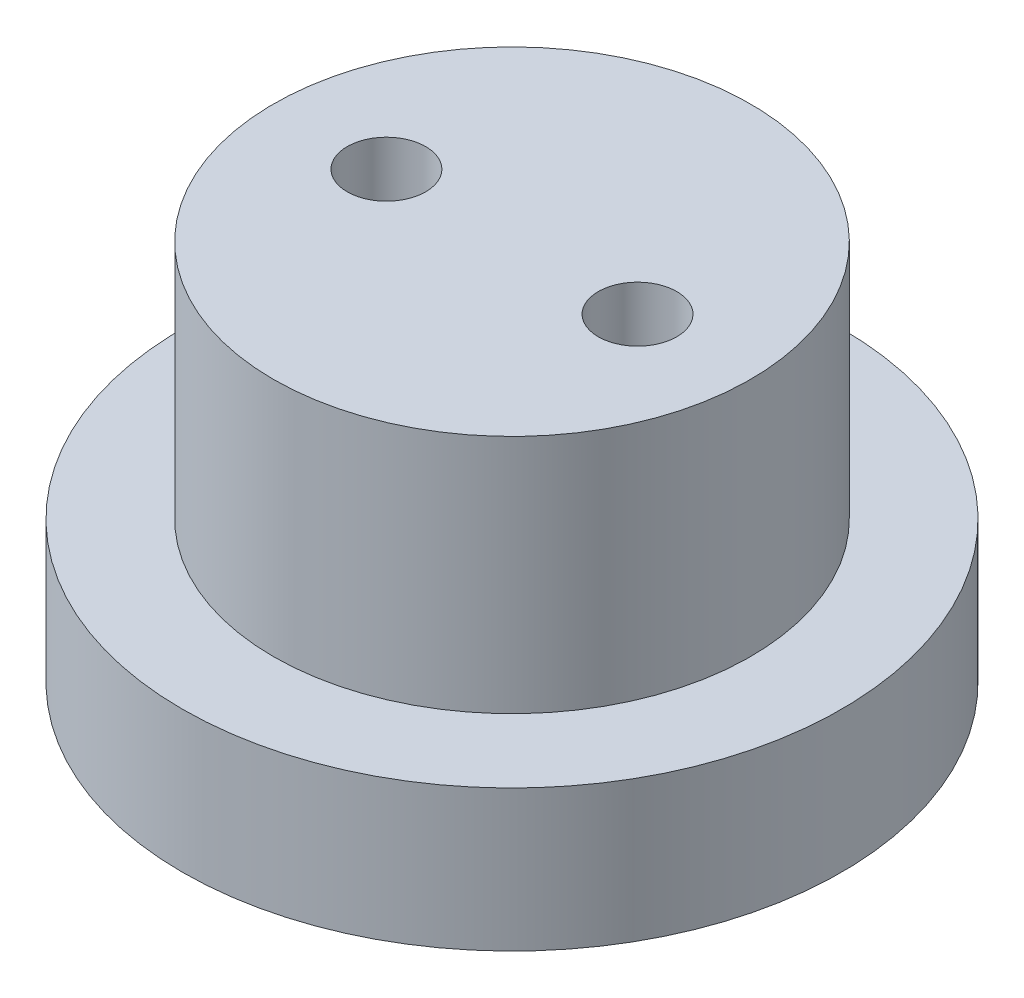
ISO-10303-21;
HEADER;
FILE_DESCRIPTION(('STEP AP214'),'2;1');
FILE_NAME('part.step','',(''),(''),'','','');
FILE_SCHEMA(('AUTOMOTIVE_DESIGN { 1 0 10303 214 1 1 1 1 }'));
ENDSEC;
DATA;
#1=APPLICATION_CONTEXT('core data for automotive mechanical design processes');
#2=APPLICATION_PROTOCOL_DEFINITION('international standard','automotive_design',2000,#1);
#3=PRODUCT_CONTEXT('',#1,'mechanical');
#4=PRODUCT('Part','Part','',(#3));
#5=PRODUCT_RELATED_PRODUCT_CATEGORY('part','',(#4));
#6=PRODUCT_DEFINITION_FORMATION('','',#4);
#7=PRODUCT_DEFINITION_CONTEXT('part definition',#1,'design');
#8=PRODUCT_DEFINITION('design','',#6,#7);
#9=PRODUCT_DEFINITION_SHAPE('','',#8);
#10=(LENGTH_UNIT() NAMED_UNIT(*) SI_UNIT(.MILLI.,.METRE.));
#11=(NAMED_UNIT(*) PLANE_ANGLE_UNIT() SI_UNIT($,.RADIAN.));
#12=(NAMED_UNIT(*) SI_UNIT($,.STERADIAN.) SOLID_ANGLE_UNIT());
#13=UNCERTAINTY_MEASURE_WITH_UNIT(LENGTH_MEASURE(1.E-05),#10,'distance_accuracy_value','');
#14=(GEOMETRIC_REPRESENTATION_CONTEXT(3) GLOBAL_UNCERTAINTY_ASSIGNED_CONTEXT((#13)) GLOBAL_UNIT_ASSIGNED_CONTEXT((#10,
#11,#12)) REPRESENTATION_CONTEXT('',''));
#15=CARTESIAN_POINT('',(0.,0.,0.));
#16=DIRECTION('',(0.,0.,1.));
#17=DIRECTION('',(1.,0.,0.));
#18=AXIS2_PLACEMENT_3D('',#15,#16,#17);
#19=CARTESIAN_POINT('',(0.,10.15,0.));
#20=DIRECTION('',(0.,1.,0.));
#21=DIRECTION('',(0.,0.,1.));
#22=AXIS2_PLACEMENT_3D('',#19,#20,#21);
#23=PLANE('',#22);
#24=CARTESIAN_POINT('',(4.,10.15,0.));
#25=DIRECTION('',(0.,1.,0.));
#26=DIRECTION('',(0.,0.,1.));
#27=AXIS2_PLACEMENT_3D('',#24,#25,#26);
#28=CIRCLE('',#27,1.25);
#29=CARTESIAN_POINT('',(4.,10.15,1.25));
#30=VERTEX_POINT('',#29);
#31=EDGE_CURVE('E54',#30,#30,#28,.T.);
#32=ORIENTED_EDGE('',*,*,#31,.F.);
#33=EDGE_LOOP('',(#32));
#34=FACE_BOUND('',#33,.T.);
#35=CARTESIAN_POINT('',(0.,10.15,0.));
#36=DIRECTION('',(0.,1.,0.));
#37=DIRECTION('',(0.,0.,1.));
#38=AXIS2_PLACEMENT_3D('',#35,#36,#37);
#39=CIRCLE('',#38,7.6);
#40=CARTESIAN_POINT('',(0.,10.15,7.6));
#41=VERTEX_POINT('',#40);
#42=EDGE_CURVE('E11',#41,#41,#39,.T.);
#43=ORIENTED_EDGE('',*,*,#42,.T.);
#44=EDGE_LOOP('',(#43));
#45=FACE_BOUND('',#44,.T.);
#46=CARTESIAN_POINT('',(-4.,10.15,0.));
#47=DIRECTION('',(0.,1.,0.));
#48=DIRECTION('',(0.,0.,1.));
#49=AXIS2_PLACEMENT_3D('',#46,#47,#48);
#50=CIRCLE('',#49,1.25);
#51=CARTESIAN_POINT('',(-4.,10.15,1.25));
#52=VERTEX_POINT('',#51);
#53=EDGE_CURVE('E60',#52,#52,#50,.T.);
#54=ORIENTED_EDGE('',*,*,#53,.F.);
#55=EDGE_LOOP('',(#54));
#56=FACE_BOUND('',#55,.T.);
#57=ADVANCED_FACE('F45',(#34,#45,#56),#23,.T.);
#58=CARTESIAN_POINT('',(0.,10.15,0.));
#59=DIRECTION('',(0.,-1.,0.));
#60=DIRECTION('',(0.,0.,-1.));
#61=AXIS2_PLACEMENT_3D('',#58,#59,#60);
#62=CYLINDRICAL_SURFACE('',#61,7.6);
#63=CARTESIAN_POINT('',(0.,2.5,0.));
#64=DIRECTION('',(0.,1.,0.));
#65=DIRECTION('',(0.,0.,1.));
#66=AXIS2_PLACEMENT_3D('',#63,#64,#65);
#67=CIRCLE('',#66,7.6);
#68=CARTESIAN_POINT('',(0.,2.5,7.6));
#69=VERTEX_POINT('',#68);
#70=EDGE_CURVE('E88',#69,#69,#67,.T.);
#71=ORIENTED_EDGE('',*,*,#70,.T.);
#72=EDGE_LOOP('',(#71));
#73=FACE_BOUND('',#72,.T.);
#74=ORIENTED_EDGE('',*,*,#42,.F.);
#75=EDGE_LOOP('',(#74));
#76=FACE_BOUND('',#75,.T.);
#77=ADVANCED_FACE('F47',(#73,#76),#62,.T.);
#78=CARTESIAN_POINT('',(4.,10.15,0.));
#79=DIRECTION('',(0.,-1.,0.));
#80=DIRECTION('',(0.,0.,-1.));
#81=AXIS2_PLACEMENT_3D('',#78,#79,#80);
#82=CYLINDRICAL_SURFACE('',#81,1.25);
#83=CARTESIAN_POINT('',(4.,2.15,0.));
#84=DIRECTION('',(0.,1.,0.));
#85=DIRECTION('',(0.,0.,1.));
#86=AXIS2_PLACEMENT_3D('',#83,#84,#85);
#87=CIRCLE('',#86,1.25);
#88=CARTESIAN_POINT('',(4.,2.15,1.25));
#89=VERTEX_POINT('',#88);
#90=EDGE_CURVE('E49',#89,#89,#87,.T.);
#91=ORIENTED_EDGE('',*,*,#90,.F.);
#92=EDGE_LOOP('',(#91));
#93=FACE_BOUND('',#92,.T.);
#94=ORIENTED_EDGE('',*,*,#31,.T.);
#95=EDGE_LOOP('',(#94));
#96=FACE_BOUND('',#95,.T.);
#97=ADVANCED_FACE('F102',(#93,#96),#82,.F.);
#98=CARTESIAN_POINT('',(-4.,10.15,0.));
#99=DIRECTION('',(0.,-1.,0.));
#100=DIRECTION('',(0.,0.,-1.));
#101=AXIS2_PLACEMENT_3D('',#98,#99,#100);
#102=CYLINDRICAL_SURFACE('',#101,1.25);
#103=CARTESIAN_POINT('',(-4.,2.15,0.));
#104=DIRECTION('',(0.,1.,0.));
#105=DIRECTION('',(0.,0.,1.));
#106=AXIS2_PLACEMENT_3D('',#103,#104,#105);
#107=CIRCLE('',#106,1.25);
#108=CARTESIAN_POINT('',(-4.,2.15,1.25));
#109=VERTEX_POINT('',#108);
#110=EDGE_CURVE('E63',#109,#109,#107,.T.);
#111=ORIENTED_EDGE('',*,*,#110,.F.);
#112=EDGE_LOOP('',(#111));
#113=FACE_BOUND('',#112,.T.);
#114=ORIENTED_EDGE('',*,*,#53,.T.);
#115=EDGE_LOOP('',(#114));
#116=FACE_BOUND('',#115,.T.);
#117=ADVANCED_FACE('F95',(#113,#116),#102,.F.);
#118=CARTESIAN_POINT('',(0.,2.5,0.));
#119=DIRECTION('',(0.,1.,0.));
#120=DIRECTION('',(0.,0.,1.));
#121=AXIS2_PLACEMENT_3D('',#118,#119,#120);
#122=PLANE('',#121);
#123=CARTESIAN_POINT('',(0.,2.5,0.));
#124=DIRECTION('',(0.,1.,0.));
#125=DIRECTION('',(0.,0.,1.));
#126=AXIS2_PLACEMENT_3D('',#123,#124,#125);
#127=CIRCLE('',#126,10.5);
#128=CARTESIAN_POINT('',(0.,2.5,10.5));
#129=VERTEX_POINT('',#128);
#130=EDGE_CURVE('E72',#129,#129,#127,.T.);
#131=ORIENTED_EDGE('',*,*,#130,.T.);
#132=EDGE_LOOP('',(#131));
#133=FACE_BOUND('',#132,.T.);
#134=ORIENTED_EDGE('',*,*,#70,.F.);
#135=EDGE_LOOP('',(#134));
#136=FACE_BOUND('',#135,.T.);
#137=ADVANCED_FACE('F111',(#133,#136),#122,.T.);
#138=CARTESIAN_POINT('',(0.,2.5,0.));
#139=DIRECTION('',(0.,-1.,0.));
#140=DIRECTION('',(0.,0.,-1.));
#141=AXIS2_PLACEMENT_3D('',#138,#139,#140);
#142=CYLINDRICAL_SURFACE('',#141,10.5);
#143=ORIENTED_EDGE('',*,*,#130,.F.);
#144=EDGE_LOOP('',(#143));
#145=FACE_BOUND('',#144,.T.);
#146=CARTESIAN_POINT('',(0.,-2.,0.));
#147=DIRECTION('',(0.,-1.,0.));
#148=DIRECTION('',(0.,0.,-1.));
#149=AXIS2_PLACEMENT_3D('',#146,#147,#148);
#150=CIRCLE('',#149,10.5);
#151=CARTESIAN_POINT('',(0.,-2.,-10.5));
#152=VERTEX_POINT('',#151);
#153=EDGE_CURVE('E80',#152,#152,#150,.T.);
#154=ORIENTED_EDGE('',*,*,#153,.F.);
#155=EDGE_LOOP('',(#154));
#156=FACE_BOUND('',#155,.T.);
#157=ADVANCED_FACE('F113',(#145,#156),#142,.T.);
#158=CARTESIAN_POINT('',(0.,2.15,0.));
#159=DIRECTION('',(0.,1.,0.));
#160=DIRECTION('',(0.,0.,1.));
#161=AXIS2_PLACEMENT_3D('',#158,#159,#160);
#162=PLANE('',#161);
#163=ORIENTED_EDGE('',*,*,#110,.T.);
#164=EDGE_LOOP('',(#163));
#165=FACE_BOUND('',#164,.T.);
#166=CARTESIAN_POINT('',(-4.,2.15,0.));
#167=DIRECTION('',(0.,1.,0.));
#168=DIRECTION('',(0.,0.,1.));
#169=AXIS2_PLACEMENT_3D('',#166,#167,#168);
#170=CIRCLE('',#169,2.675);
#171=CARTESIAN_POINT('',(-4.,2.15,2.675));
#172=VERTEX_POINT('',#171);
#173=EDGE_CURVE('E74',#172,#172,#170,.F.);
#174=ORIENTED_EDGE('',*,*,#173,.T.);
#175=EDGE_LOOP('',(#174));
#176=FACE_BOUND('',#175,.T.);
#177=ADVANCED_FACE('F116',(#165,#176),#162,.F.);
#178=CARTESIAN_POINT('',(-4.,17.7160425586961,0.));
#179=DIRECTION('',(0.,-1.,0.));
#180=DIRECTION('',(0.,0.,-1.));
#181=AXIS2_PLACEMENT_3D('',#178,#179,#180);
#182=CYLINDRICAL_SURFACE('',#181,2.675);
#183=ORIENTED_EDGE('',*,*,#173,.F.);
#184=EDGE_LOOP('',(#183));
#185=FACE_BOUND('',#184,.T.);
#186=CARTESIAN_POINT('',(-4.,-2.,0.));
#187=DIRECTION('',(0.,-1.,0.));
#188=DIRECTION('',(0.,0.,-1.));
#189=AXIS2_PLACEMENT_3D('',#186,#187,#188);
#190=CIRCLE('',#189,2.675);
#191=CARTESIAN_POINT('',(-4.,-2.,-2.675));
#192=VERTEX_POINT('',#191);
#193=EDGE_CURVE('E143',#192,#192,#190,.T.);
#194=ORIENTED_EDGE('',*,*,#193,.T.);
#195=EDGE_LOOP('',(#194));
#196=FACE_BOUND('',#195,.T.);
#197=ADVANCED_FACE('F121',(#185,#196),#182,.F.);
#198=CARTESIAN_POINT('',(0.,2.15,0.));
#199=DIRECTION('',(0.,1.,0.));
#200=DIRECTION('',(0.,0.,1.));
#201=AXIS2_PLACEMENT_3D('',#198,#199,#200);
#202=PLANE('',#201);
#203=ORIENTED_EDGE('',*,*,#90,.T.);
#204=EDGE_LOOP('',(#203));
#205=FACE_BOUND('',#204,.T.);
#206=CARTESIAN_POINT('',(4.,2.15,0.));
#207=DIRECTION('',(0.,1.,0.));
#208=DIRECTION('',(0.,0.,1.));
#209=AXIS2_PLACEMENT_3D('',#206,#207,#208);
#210=CIRCLE('',#209,2.675);
#211=CARTESIAN_POINT('',(4.,2.15,2.675));
#212=VERTEX_POINT('',#211);
#213=EDGE_CURVE('E66',#212,#212,#210,.F.);
#214=ORIENTED_EDGE('',*,*,#213,.T.);
#215=EDGE_LOOP('',(#214));
#216=FACE_BOUND('',#215,.T.);
#217=ADVANCED_FACE('F124',(#205,#216),#202,.F.);
#218=CARTESIAN_POINT('',(4.,17.7160425586961,0.));
#219=DIRECTION('',(0.,-1.,0.));
#220=DIRECTION('',(0.,0.,-1.));
#221=AXIS2_PLACEMENT_3D('',#218,#219,#220);
#222=CYLINDRICAL_SURFACE('',#221,2.675);
#223=ORIENTED_EDGE('',*,*,#213,.F.);
#224=EDGE_LOOP('',(#223));
#225=FACE_BOUND('',#224,.T.);
#226=CARTESIAN_POINT('',(4.,-2.,0.));
#227=DIRECTION('',(0.,-1.,0.));
#228=DIRECTION('',(0.,0.,-1.));
#229=AXIS2_PLACEMENT_3D('',#226,#227,#228);
#230=CIRCLE('',#229,2.675);
#231=CARTESIAN_POINT('',(4.,-2.,-2.675));
#232=VERTEX_POINT('',#231);
#233=EDGE_CURVE('E149',#232,#232,#230,.T.);
#234=ORIENTED_EDGE('',*,*,#233,.T.);
#235=EDGE_LOOP('',(#234));
#236=FACE_BOUND('',#235,.T.);
#237=ADVANCED_FACE('F130',(#225,#236),#222,.F.);
#238=CARTESIAN_POINT('',(0.,-2.,0.));
#239=DIRECTION('',(0.,-1.,0.));
#240=DIRECTION('',(0.,0.,-1.));
#241=AXIS2_PLACEMENT_3D('',#238,#239,#240);
#242=PLANE('',#241);
#243=ORIENTED_EDGE('',*,*,#193,.F.);
#244=EDGE_LOOP('',(#243));
#245=FACE_BOUND('',#244,.T.);
#246=ORIENTED_EDGE('',*,*,#153,.T.);
#247=EDGE_LOOP('',(#246));
#248=FACE_BOUND('',#247,.T.);
#249=ORIENTED_EDGE('',*,*,#233,.F.);
#250=EDGE_LOOP('',(#249));
#251=FACE_BOUND('',#250,.T.);
#252=ADVANCED_FACE('F134',(#245,#248,#251),#242,.T.);
#253=CLOSED_SHELL('',(#57,#77,#97,#117,#137,#157,#177,#197,#217,#237,#252));
#254=MANIFOLD_SOLID_BREP('B2',#253);
#255=ADVANCED_BREP_SHAPE_REPRESENTATION('',(#18,#254),#14);
#256=SHAPE_DEFINITION_REPRESENTATION(#9,#255);
ENDSEC;
END-ISO-10303-21;
